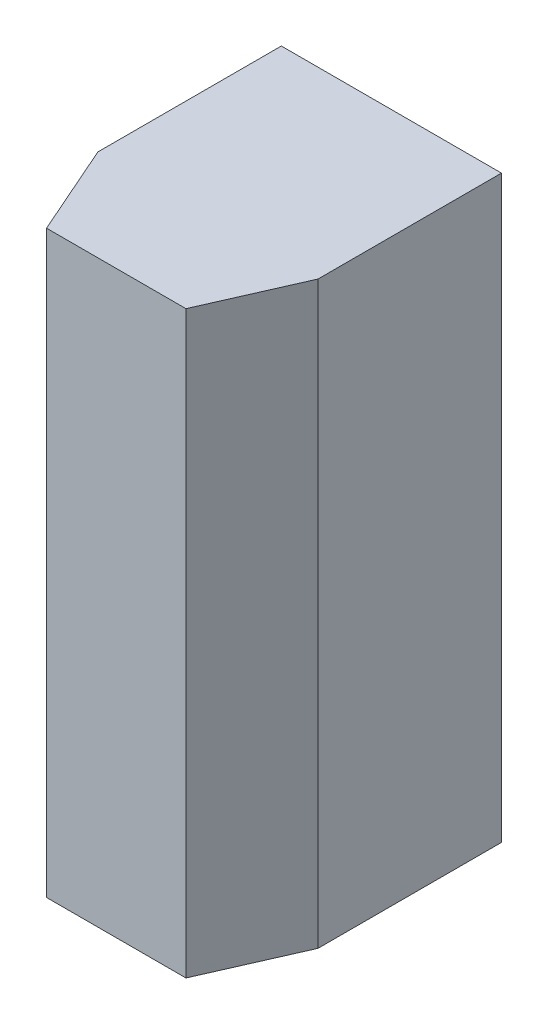
ISO-10303-21;
HEADER;
FILE_DESCRIPTION(('STEP AP214'),'2;1');
FILE_NAME('part.step','',(''),(''),'','','');
FILE_SCHEMA(('AUTOMOTIVE_DESIGN { 1 0 10303 214 1 1 1 1 }'));
ENDSEC;
DATA;
#1=APPLICATION_CONTEXT('core data for automotive mechanical design processes');
#2=APPLICATION_PROTOCOL_DEFINITION('international standard','automotive_design',2000,#1);
#3=PRODUCT_CONTEXT('',#1,'mechanical');
#4=PRODUCT('Part','Part','',(#3));
#5=PRODUCT_RELATED_PRODUCT_CATEGORY('part','',(#4));
#6=PRODUCT_DEFINITION_FORMATION('','',#4);
#7=PRODUCT_DEFINITION_CONTEXT('part definition',#1,'design');
#8=PRODUCT_DEFINITION('design','',#6,#7);
#9=PRODUCT_DEFINITION_SHAPE('','',#8);
#10=(LENGTH_UNIT() NAMED_UNIT(*) SI_UNIT(.MILLI.,.METRE.));
#11=(NAMED_UNIT(*) PLANE_ANGLE_UNIT() SI_UNIT($,.RADIAN.));
#12=(NAMED_UNIT(*) SI_UNIT($,.STERADIAN.) SOLID_ANGLE_UNIT());
#13=UNCERTAINTY_MEASURE_WITH_UNIT(LENGTH_MEASURE(1.E-05),#10,'distance_accuracy_value','');
#14=(GEOMETRIC_REPRESENTATION_CONTEXT(3) GLOBAL_UNCERTAINTY_ASSIGNED_CONTEXT((#13)) GLOBAL_UNIT_ASSIGNED_CONTEXT((#10,
#11,#12)) REPRESENTATION_CONTEXT('',''));
#15=CARTESIAN_POINT('',(0.,0.,0.));
#16=DIRECTION('',(0.,0.,1.));
#17=DIRECTION('',(1.,0.,0.));
#18=AXIS2_PLACEMENT_3D('',#15,#16,#17);
#19=CARTESIAN_POINT('',(0.,0.,6.35));
#20=DIRECTION('',(1.,0.,0.));
#21=DIRECTION('',(0.,0.,-1.));
#22=AXIS2_PLACEMENT_3D('',#19,#20,#21);
#23=PLANE('',#22);
#24=DIRECTION('',(0.,-1.,0.));
#25=VECTOR('',#24,1.);
#26=CARTESIAN_POINT('',(0.,0.,0.));
#27=LINE('',#26,#25);
#28=CARTESIAN_POINT('',(0.,20.066,0.));
#29=VERTEX_POINT('',#28);
#30=CARTESIAN_POINT('',(0.,0.,0.));
#31=VERTEX_POINT('',#30);
#32=EDGE_CURVE('E130',#29,#31,#27,.T.);
#33=ORIENTED_EDGE('',*,*,#32,.T.);
#34=DIRECTION('',(0.,0.,-1.));
#35=VECTOR('',#34,1.);
#36=CARTESIAN_POINT('',(0.,0.,6.35));
#37=LINE('',#36,#35);
#38=CARTESIAN_POINT('',(0.,0.,6.35));
#39=VERTEX_POINT('',#38);
#40=EDGE_CURVE('E11',#39,#31,#37,.T.);
#41=ORIENTED_EDGE('',*,*,#40,.F.);
#42=DIRECTION('',(0.,-1.,0.));
#43=VECTOR('',#42,1.);
#44=CARTESIAN_POINT('',(0.,0.,6.35));
#45=LINE('',#44,#43);
#46=CARTESIAN_POINT('',(0.,20.066,6.35));
#47=VERTEX_POINT('',#46);
#48=EDGE_CURVE('E131',#47,#39,#45,.T.);
#49=ORIENTED_EDGE('',*,*,#48,.F.);
#50=DIRECTION('',(0.,0.,-1.));
#51=VECTOR('',#50,1.);
#52=CARTESIAN_POINT('',(0.,20.066,6.35));
#53=LINE('',#52,#51);
#54=EDGE_CURVE('E135',#47,#29,#53,.T.);
#55=ORIENTED_EDGE('',*,*,#54,.T.);
#56=EDGE_LOOP('',(#33,#41,#49,#55));
#57=FACE_BOUND('',#56,.T.);
#58=ADVANCED_FACE('F39',(#57),#23,.F.);
#59=CARTESIAN_POINT('',(0.,0.,6.35));
#60=DIRECTION('',(0.,1.,0.));
#61=DIRECTION('',(0.,0.,1.));
#62=AXIS2_PLACEMENT_3D('',#59,#60,#61);
#63=PLANE('',#62);
#64=DIRECTION('',(1.,0.,0.));
#65=VECTOR('',#64,1.);
#66=CARTESIAN_POINT('',(0.,0.,0.));
#67=LINE('',#66,#65);
#68=CARTESIAN_POINT('',(7.62,0.,0.));
#69=VERTEX_POINT('',#68);
#70=EDGE_CURVE('E137',#31,#69,#67,.T.);
#71=ORIENTED_EDGE('',*,*,#70,.T.);
#72=DIRECTION('',(0.,0.,-1.));
#73=VECTOR('',#72,1.);
#74=CARTESIAN_POINT('',(7.62,0.,6.35));
#75=LINE('',#74,#73);
#76=CARTESIAN_POINT('',(7.62,0.,6.35));
#77=VERTEX_POINT('',#76);
#78=EDGE_CURVE('E47',#77,#69,#75,.T.);
#79=ORIENTED_EDGE('',*,*,#78,.F.);
#80=DIRECTION('',(-0.402738614266017,0.,0.915315032422766));
#81=VECTOR('',#80,1.);
#82=CARTESIAN_POINT('',(6.223,0.,9.525));
#83=LINE('',#82,#81);
#84=CARTESIAN_POINT('',(6.223,0.,9.525));
#85=VERTEX_POINT('',#84);
#86=EDGE_CURVE('E105',#77,#85,#83,.T.);
#87=ORIENTED_EDGE('',*,*,#86,.T.);
#88=DIRECTION('',(-1.,0.,0.));
#89=VECTOR('',#88,1.);
#90=CARTESIAN_POINT('',(1.397,0.,9.525));
#91=LINE('',#90,#89);
#92=CARTESIAN_POINT('',(1.397,0.,9.525));
#93=VERTEX_POINT('',#92);
#94=EDGE_CURVE('E113',#85,#93,#91,.T.);
#95=ORIENTED_EDGE('',*,*,#94,.T.);
#96=DIRECTION('',(-0.402738614266017,0.,-0.915315032422766));
#97=VECTOR('',#96,1.);
#98=CARTESIAN_POINT('',(0.,0.,6.35));
#99=LINE('',#98,#97);
#100=EDGE_CURVE('E110',#93,#39,#99,.T.);
#101=ORIENTED_EDGE('',*,*,#100,.T.);
#102=ORIENTED_EDGE('',*,*,#40,.T.);
#103=EDGE_LOOP('',(#71,#79,#87,#95,#101,#102));
#104=FACE_BOUND('',#103,.T.);
#105=ADVANCED_FACE('F120',(#104),#63,.F.);
#106=CARTESIAN_POINT('',(7.62,0.,6.35));
#107=DIRECTION('',(-1.,0.,0.));
#108=DIRECTION('',(0.,0.,1.));
#109=AXIS2_PLACEMENT_3D('',#106,#107,#108);
#110=PLANE('',#109);
#111=DIRECTION('',(0.,1.,0.));
#112=VECTOR('',#111,1.);
#113=CARTESIAN_POINT('',(7.62,0.,0.));
#114=LINE('',#113,#112);
#115=CARTESIAN_POINT('',(7.62,20.066,0.));
#116=VERTEX_POINT('',#115);
#117=EDGE_CURVE('E71',#69,#116,#114,.T.);
#118=ORIENTED_EDGE('',*,*,#117,.T.);
#119=DIRECTION('',(0.,0.,-1.));
#120=VECTOR('',#119,1.);
#121=CARTESIAN_POINT('',(7.62,20.066,6.35));
#122=LINE('',#121,#120);
#123=CARTESIAN_POINT('',(7.62,20.066,6.35));
#124=VERTEX_POINT('',#123);
#125=EDGE_CURVE('E55',#124,#116,#122,.T.);
#126=ORIENTED_EDGE('',*,*,#125,.F.);
#127=DIRECTION('',(0.,1.,0.));
#128=VECTOR('',#127,1.);
#129=CARTESIAN_POINT('',(7.62,0.,6.35));
#130=LINE('',#129,#128);
#131=EDGE_CURVE('E133',#77,#124,#130,.T.);
#132=ORIENTED_EDGE('',*,*,#131,.F.);
#133=ORIENTED_EDGE('',*,*,#78,.T.);
#134=EDGE_LOOP('',(#118,#126,#132,#133));
#135=FACE_BOUND('',#134,.T.);
#136=ADVANCED_FACE('F142',(#135),#110,.F.);
#137=CARTESIAN_POINT('',(0.,20.066,6.35));
#138=DIRECTION('',(0.,-1.,0.));
#139=DIRECTION('',(0.,0.,-1.));
#140=AXIS2_PLACEMENT_3D('',#137,#138,#139);
#141=PLANE('',#140);
#142=DIRECTION('',(-1.,0.,0.));
#143=VECTOR('',#142,1.);
#144=CARTESIAN_POINT('',(0.,20.066,0.));
#145=LINE('',#144,#143);
#146=EDGE_CURVE('E76',#116,#29,#145,.T.);
#147=ORIENTED_EDGE('',*,*,#146,.T.);
#148=ORIENTED_EDGE('',*,*,#54,.F.);
#149=DIRECTION('',(0.402738614266017,0.,0.915315032422766));
#150=VECTOR('',#149,1.);
#151=CARTESIAN_POINT('',(0.,20.066,6.35));
#152=LINE('',#151,#150);
#153=CARTESIAN_POINT('',(1.397,20.066,9.525));
#154=VERTEX_POINT('',#153);
#155=EDGE_CURVE('E123',#47,#154,#152,.T.);
#156=ORIENTED_EDGE('',*,*,#155,.T.);
#157=DIRECTION('',(1.,0.,0.));
#158=VECTOR('',#157,1.);
#159=CARTESIAN_POINT('',(1.397,20.066,9.525));
#160=LINE('',#159,#158);
#161=CARTESIAN_POINT('',(6.223,20.066,9.525));
#162=VERTEX_POINT('',#161);
#163=EDGE_CURVE('E127',#154,#162,#160,.T.);
#164=ORIENTED_EDGE('',*,*,#163,.T.);
#165=DIRECTION('',(0.402738614266017,0.,-0.915315032422766));
#166=VECTOR('',#165,1.);
#167=CARTESIAN_POINT('',(6.223,20.066,9.525));
#168=LINE('',#167,#166);
#169=EDGE_CURVE('E106',#162,#124,#168,.T.);
#170=ORIENTED_EDGE('',*,*,#169,.T.);
#171=ORIENTED_EDGE('',*,*,#125,.T.);
#172=EDGE_LOOP('',(#147,#148,#156,#164,#170,#171));
#173=FACE_BOUND('',#172,.T.);
#174=ADVANCED_FACE('F147',(#173),#141,.F.);
#175=CARTESIAN_POINT('',(0.,0.,0.));
#176=DIRECTION('',(0.,0.,-1.));
#177=DIRECTION('',(-1.,0.,0.));
#178=AXIS2_PLACEMENT_3D('',#175,#176,#177);
#179=PLANE('',#178);
#180=ORIENTED_EDGE('',*,*,#32,.F.);
#181=ORIENTED_EDGE('',*,*,#146,.F.);
#182=ORIENTED_EDGE('',*,*,#117,.F.);
#183=ORIENTED_EDGE('',*,*,#70,.F.);
#184=EDGE_LOOP('',(#180,#181,#182,#183));
#185=FACE_BOUND('',#184,.T.);
#186=ADVANCED_FACE('F145',(#185),#179,.T.);
#187=CARTESIAN_POINT('',(0.,28.321,6.35));
#188=DIRECTION('',(-0.915315032422766,0.,0.402738614266017));
#189=DIRECTION('',(0.402738614266017,0.,0.915315032422766));
#190=AXIS2_PLACEMENT_3D('',#187,#188,#189);
#191=PLANE('',#190);
#192=ORIENTED_EDGE('',*,*,#155,.F.);
#193=ORIENTED_EDGE('',*,*,#48,.T.);
#194=ORIENTED_EDGE('',*,*,#100,.F.);
#195=DIRECTION('',(0.,-1.,0.));
#196=VECTOR('',#195,1.);
#197=CARTESIAN_POINT('',(1.397,28.321,9.525));
#198=LINE('',#197,#196);
#199=EDGE_CURVE('E109',#154,#93,#198,.T.);
#200=ORIENTED_EDGE('',*,*,#199,.F.);
#201=EDGE_LOOP('',(#192,#193,#194,#200));
#202=FACE_BOUND('',#201,.T.);
#203=ADVANCED_FACE('F149',(#202),#191,.T.);
#204=CARTESIAN_POINT('',(1.397,28.321,9.525));
#205=DIRECTION('',(0.,0.,1.));
#206=DIRECTION('',(1.,0.,0.));
#207=AXIS2_PLACEMENT_3D('',#204,#205,#206);
#208=PLANE('',#207);
#209=ORIENTED_EDGE('',*,*,#163,.F.);
#210=ORIENTED_EDGE('',*,*,#199,.T.);
#211=ORIENTED_EDGE('',*,*,#94,.F.);
#212=DIRECTION('',(0.,-1.,0.));
#213=VECTOR('',#212,1.);
#214=CARTESIAN_POINT('',(6.223,28.321,9.525));
#215=LINE('',#214,#213);
#216=EDGE_CURVE('E100',#162,#85,#215,.T.);
#217=ORIENTED_EDGE('',*,*,#216,.F.);
#218=EDGE_LOOP('',(#209,#210,#211,#217));
#219=FACE_BOUND('',#218,.T.);
#220=ADVANCED_FACE('F114',(#219),#208,.T.);
#221=CARTESIAN_POINT('',(6.223,28.321,9.525));
#222=DIRECTION('',(0.915315032422766,0.,0.402738614266017));
#223=DIRECTION('',(0.402738614266017,0.,-0.915315032422766));
#224=AXIS2_PLACEMENT_3D('',#221,#222,#223);
#225=PLANE('',#224);
#226=ORIENTED_EDGE('',*,*,#169,.F.);
#227=ORIENTED_EDGE('',*,*,#216,.T.);
#228=ORIENTED_EDGE('',*,*,#86,.F.);
#229=ORIENTED_EDGE('',*,*,#131,.T.);
#230=EDGE_LOOP('',(#226,#227,#228,#229));
#231=FACE_BOUND('',#230,.T.);
#232=ADVANCED_FACE('F102',(#231),#225,.T.);
#233=CLOSED_SHELL('',(#58,#105,#136,#174,#186,#203,#220,#232));
#234=MANIFOLD_SOLID_BREP('B2',#233);
#235=ADVANCED_BREP_SHAPE_REPRESENTATION('',(#18,#234),#14);
#236=SHAPE_DEFINITION_REPRESENTATION(#9,#235);
ENDSEC;
END-ISO-10303-21;
